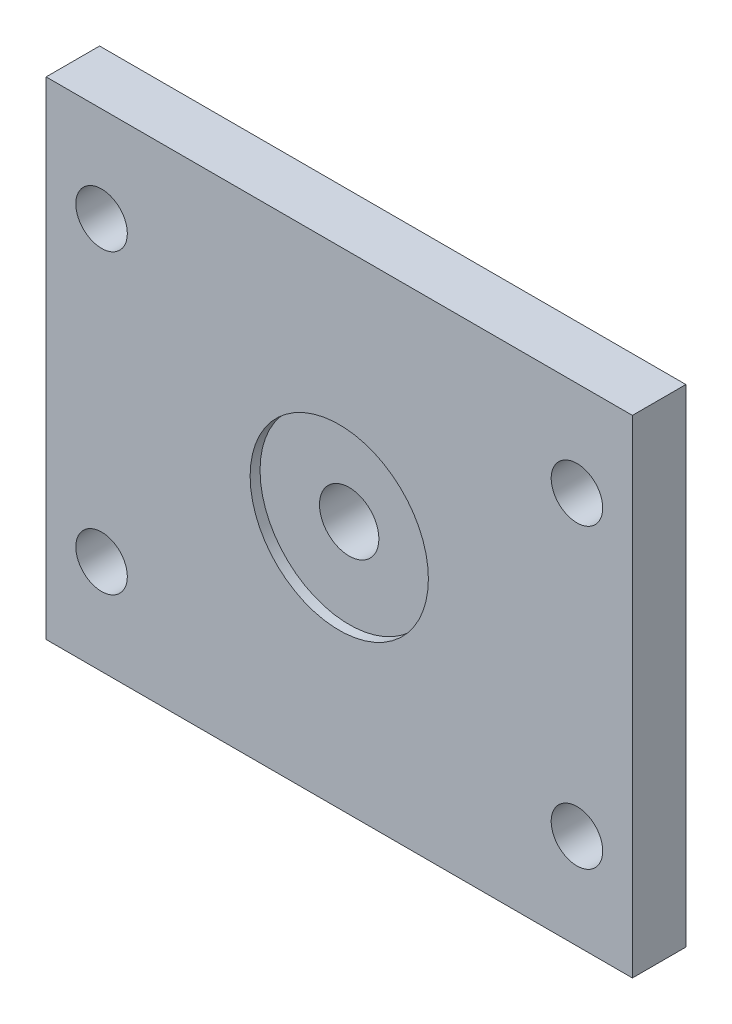
ISO-10303-21;
HEADER;
FILE_DESCRIPTION(('STEP AP214'),'2;1');
FILE_NAME('part.step','',(''),(''),'','','');
FILE_SCHEMA(('AUTOMOTIVE_DESIGN { 1 0 10303 214 1 1 1 1 }'));
ENDSEC;
DATA;
#1=APPLICATION_CONTEXT('core data for automotive mechanical design processes');
#2=APPLICATION_PROTOCOL_DEFINITION('international standard','automotive_design',2000,#1);
#3=PRODUCT_CONTEXT('',#1,'mechanical');
#4=PRODUCT('Part','Part','',(#3));
#5=PRODUCT_RELATED_PRODUCT_CATEGORY('part','',(#4));
#6=PRODUCT_DEFINITION_FORMATION('','',#4);
#7=PRODUCT_DEFINITION_CONTEXT('part definition',#1,'design');
#8=PRODUCT_DEFINITION('design','',#6,#7);
#9=PRODUCT_DEFINITION_SHAPE('','',#8);
#10=(LENGTH_UNIT() NAMED_UNIT(*) SI_UNIT(.MILLI.,.METRE.));
#11=(NAMED_UNIT(*) PLANE_ANGLE_UNIT() SI_UNIT($,.RADIAN.));
#12=(NAMED_UNIT(*) SI_UNIT($,.STERADIAN.) SOLID_ANGLE_UNIT());
#13=UNCERTAINTY_MEASURE_WITH_UNIT(LENGTH_MEASURE(1.E-05),#10,'distance_accuracy_value','');
#14=(GEOMETRIC_REPRESENTATION_CONTEXT(3) GLOBAL_UNCERTAINTY_ASSIGNED_CONTEXT((#13)) GLOBAL_UNIT_ASSIGNED_CONTEXT((#10,
#11,#12)) REPRESENTATION_CONTEXT('',''));
#15=CARTESIAN_POINT('',(0.,0.,0.));
#16=DIRECTION('',(0.,0.,1.));
#17=DIRECTION('',(1.,0.,0.));
#18=AXIS2_PLACEMENT_3D('',#15,#16,#17);
#19=CARTESIAN_POINT('',(0.,0.,27.));
#20=DIRECTION('',(0.,0.,-1.));
#21=DIRECTION('',(-1.,0.,0.));
#22=AXIS2_PLACEMENT_3D('',#19,#20,#21);
#23=CYLINDRICAL_SURFACE('',#22,15.);
#24=CARTESIAN_POINT('',(0.,0.,0.));
#25=DIRECTION('',(0.,0.,1.));
#26=DIRECTION('',(1.,0.,0.));
#27=AXIS2_PLACEMENT_3D('',#24,#25,#26);
#28=CIRCLE('',#27,15.);
#29=CARTESIAN_POINT('',(15.,0.,0.));
#30=VERTEX_POINT('',#29);
#31=EDGE_CURVE('E138',#30,#30,#28,.T.);
#32=ORIENTED_EDGE('',*,*,#31,.F.);
#33=EDGE_LOOP('',(#32));
#34=FACE_BOUND('',#33,.T.);
#35=CARTESIAN_POINT('',(0.,0.,22.));
#36=DIRECTION('',(0.,0.,1.));
#37=DIRECTION('',(1.,0.,0.));
#38=AXIS2_PLACEMENT_3D('',#35,#36,#37);
#39=CIRCLE('',#38,15.);
#40=CARTESIAN_POINT('',(15.,0.,22.));
#41=VERTEX_POINT('',#40);
#42=EDGE_CURVE('E39',#41,#41,#39,.T.);
#43=ORIENTED_EDGE('',*,*,#42,.T.);
#44=EDGE_LOOP('',(#43));
#45=FACE_BOUND('',#44,.T.);
#46=ADVANCED_FACE('F35',(#34,#45),#23,.F.);
#47=CARTESIAN_POINT('',(-148.,123.,27.));
#48=DIRECTION('',(0.,0.,1.));
#49=DIRECTION('',(1.,0.,0.));
#50=AXIS2_PLACEMENT_3D('',#47,#48,#49);
#51=PLANE('',#50);
#52=CARTESIAN_POINT('',(0.,0.,27.));
#53=DIRECTION('',(0.,0.,1.));
#54=DIRECTION('',(1.,0.,0.));
#55=AXIS2_PLACEMENT_3D('',#52,#53,#54);
#56=CIRCLE('',#55,45.);
#57=CARTESIAN_POINT('',(45.,0.,27.));
#58=VERTEX_POINT('',#57);
#59=EDGE_CURVE('E143',#58,#58,#56,.T.);
#60=ORIENTED_EDGE('',*,*,#59,.F.);
#61=EDGE_LOOP('',(#60));
#62=FACE_BOUND('',#61,.T.);
#63=CARTESIAN_POINT('',(-120.,-75.,27.));
#64=DIRECTION('',(0.,0.,1.));
#65=DIRECTION('',(1.,0.,0.));
#66=AXIS2_PLACEMENT_3D('',#63,#64,#65);
#67=CIRCLE('',#66,13.);
#68=CARTESIAN_POINT('',(-107.,-75.,27.));
#69=VERTEX_POINT('',#68);
#70=EDGE_CURVE('E132',#69,#69,#67,.T.);
#71=ORIENTED_EDGE('',*,*,#70,.F.);
#72=EDGE_LOOP('',(#71));
#73=FACE_BOUND('',#72,.T.);
#74=CARTESIAN_POINT('',(120.,75.,27.));
#75=DIRECTION('',(0.,0.,1.));
#76=DIRECTION('',(1.,0.,0.));
#77=AXIS2_PLACEMENT_3D('',#74,#75,#76);
#78=CIRCLE('',#77,13.);
#79=CARTESIAN_POINT('',(133.,75.,27.));
#80=VERTEX_POINT('',#79);
#81=EDGE_CURVE('E120',#80,#80,#78,.T.);
#82=ORIENTED_EDGE('',*,*,#81,.F.);
#83=EDGE_LOOP('',(#82));
#84=FACE_BOUND('',#83,.T.);
#85=DIRECTION('',(0.,-1.,0.));
#86=VECTOR('',#85,1.);
#87=CARTESIAN_POINT('',(-148.,-123.,27.));
#88=LINE('',#87,#86);
#89=CARTESIAN_POINT('',(-148.,123.,27.));
#90=VERTEX_POINT('',#89);
#91=CARTESIAN_POINT('',(-148.,-123.,27.));
#92=VERTEX_POINT('',#91);
#93=EDGE_CURVE('E89',#90,#92,#88,.T.);
#94=ORIENTED_EDGE('',*,*,#93,.T.);
#95=DIRECTION('',(1.,0.,0.));
#96=VECTOR('',#95,1.);
#97=CARTESIAN_POINT('',(148.,-123.,27.));
#98=LINE('',#97,#96);
#99=CARTESIAN_POINT('',(148.,-123.,27.));
#100=VERTEX_POINT('',#99);
#101=EDGE_CURVE('E83',#92,#100,#98,.T.);
#102=ORIENTED_EDGE('',*,*,#101,.T.);
#103=DIRECTION('',(0.,1.,0.));
#104=VECTOR('',#103,1.);
#105=CARTESIAN_POINT('',(148.,-123.,27.));
#106=LINE('',#105,#104);
#107=CARTESIAN_POINT('',(148.,123.,27.));
#108=VERTEX_POINT('',#107);
#109=EDGE_CURVE('E87',#100,#108,#106,.T.);
#110=ORIENTED_EDGE('',*,*,#109,.T.);
#111=DIRECTION('',(-1.,0.,0.));
#112=VECTOR('',#111,1.);
#113=CARTESIAN_POINT('',(148.,123.,27.));
#114=LINE('',#113,#112);
#115=EDGE_CURVE('E53',#108,#90,#114,.T.);
#116=ORIENTED_EDGE('',*,*,#115,.T.);
#117=EDGE_LOOP('',(#94,#102,#110,#116));
#118=FACE_BOUND('',#117,.T.);
#119=CARTESIAN_POINT('',(-120.,75.,27.));
#120=DIRECTION('',(0.,0.,1.));
#121=DIRECTION('',(1.,0.,0.));
#122=AXIS2_PLACEMENT_3D('',#119,#120,#121);
#123=CIRCLE('',#122,13.);
#124=CARTESIAN_POINT('',(-107.,75.,27.));
#125=VERTEX_POINT('',#124);
#126=EDGE_CURVE('E105',#125,#125,#123,.T.);
#127=ORIENTED_EDGE('',*,*,#126,.F.);
#128=EDGE_LOOP('',(#127));
#129=FACE_BOUND('',#128,.T.);
#130=CARTESIAN_POINT('',(120.,-75.,27.));
#131=DIRECTION('',(0.,0.,1.));
#132=DIRECTION('',(1.,0.,0.));
#133=AXIS2_PLACEMENT_3D('',#130,#131,#132);
#134=CIRCLE('',#133,13.);
#135=CARTESIAN_POINT('',(133.,-75.,27.));
#136=VERTEX_POINT('',#135);
#137=EDGE_CURVE('E126',#136,#136,#134,.T.);
#138=ORIENTED_EDGE('',*,*,#137,.F.);
#139=EDGE_LOOP('',(#138));
#140=FACE_BOUND('',#139,.T.);
#141=ADVANCED_FACE('F84',(#62,#73,#84,#118,#129,#140),#51,.T.);
#142=CARTESIAN_POINT('',(-148.,123.,0.));
#143=DIRECTION('',(0.,0.,1.));
#144=DIRECTION('',(1.,0.,0.));
#145=AXIS2_PLACEMENT_3D('',#142,#143,#144);
#146=PLANE('',#145);
#147=CARTESIAN_POINT('',(-120.,-75.,0.));
#148=DIRECTION('',(0.,0.,1.));
#149=DIRECTION('',(1.,0.,0.));
#150=AXIS2_PLACEMENT_3D('',#147,#148,#149);
#151=CIRCLE('',#150,13.);
#152=CARTESIAN_POINT('',(-107.,-75.,0.));
#153=VERTEX_POINT('',#152);
#154=EDGE_CURVE('E135',#153,#153,#151,.T.);
#155=ORIENTED_EDGE('',*,*,#154,.T.);
#156=EDGE_LOOP('',(#155));
#157=FACE_BOUND('',#156,.T.);
#158=CARTESIAN_POINT('',(120.,75.,0.));
#159=DIRECTION('',(0.,0.,1.));
#160=DIRECTION('',(1.,0.,0.));
#161=AXIS2_PLACEMENT_3D('',#158,#159,#160);
#162=CIRCLE('',#161,13.);
#163=CARTESIAN_POINT('',(133.,75.,0.));
#164=VERTEX_POINT('',#163);
#165=EDGE_CURVE('E123',#164,#164,#162,.T.);
#166=ORIENTED_EDGE('',*,*,#165,.T.);
#167=EDGE_LOOP('',(#166));
#168=FACE_BOUND('',#167,.T.);
#169=DIRECTION('',(0.,-1.,0.));
#170=VECTOR('',#169,1.);
#171=CARTESIAN_POINT('',(-148.,-123.,0.));
#172=LINE('',#171,#170);
#173=CARTESIAN_POINT('',(-148.,123.,0.));
#174=VERTEX_POINT('',#173);
#175=CARTESIAN_POINT('',(-148.,-123.,0.));
#176=VERTEX_POINT('',#175);
#177=EDGE_CURVE('E102',#174,#176,#172,.T.);
#178=ORIENTED_EDGE('',*,*,#177,.F.);
#179=DIRECTION('',(-1.,0.,0.));
#180=VECTOR('',#179,1.);
#181=CARTESIAN_POINT('',(148.,123.,0.));
#182=LINE('',#181,#180);
#183=CARTESIAN_POINT('',(148.,123.,0.));
#184=VERTEX_POINT('',#183);
#185=EDGE_CURVE('E76',#184,#174,#182,.T.);
#186=ORIENTED_EDGE('',*,*,#185,.F.);
#187=DIRECTION('',(0.,1.,0.));
#188=VECTOR('',#187,1.);
#189=CARTESIAN_POINT('',(148.,-123.,0.));
#190=LINE('',#189,#188);
#191=CARTESIAN_POINT('',(148.,-123.,0.));
#192=VERTEX_POINT('',#191);
#193=EDGE_CURVE('E70',#192,#184,#190,.T.);
#194=ORIENTED_EDGE('',*,*,#193,.F.);
#195=DIRECTION('',(1.,0.,0.));
#196=VECTOR('',#195,1.);
#197=CARTESIAN_POINT('',(148.,-123.,0.));
#198=LINE('',#197,#196);
#199=EDGE_CURVE('E93',#176,#192,#198,.T.);
#200=ORIENTED_EDGE('',*,*,#199,.F.);
#201=EDGE_LOOP('',(#178,#186,#194,#200));
#202=FACE_BOUND('',#201,.T.);
#203=CARTESIAN_POINT('',(-120.,75.,0.));
#204=DIRECTION('',(0.,0.,1.));
#205=DIRECTION('',(1.,0.,0.));
#206=AXIS2_PLACEMENT_3D('',#203,#204,#205);
#207=CIRCLE('',#206,13.);
#208=CARTESIAN_POINT('',(-107.,75.,0.));
#209=VERTEX_POINT('',#208);
#210=EDGE_CURVE('E117',#209,#209,#207,.T.);
#211=ORIENTED_EDGE('',*,*,#210,.T.);
#212=EDGE_LOOP('',(#211));
#213=FACE_BOUND('',#212,.T.);
#214=CARTESIAN_POINT('',(120.,-75.,0.));
#215=DIRECTION('',(0.,0.,1.));
#216=DIRECTION('',(1.,0.,0.));
#217=AXIS2_PLACEMENT_3D('',#214,#215,#216);
#218=CIRCLE('',#217,13.);
#219=CARTESIAN_POINT('',(133.,-75.,0.));
#220=VERTEX_POINT('',#219);
#221=EDGE_CURVE('E129',#220,#220,#218,.T.);
#222=ORIENTED_EDGE('',*,*,#221,.T.);
#223=EDGE_LOOP('',(#222));
#224=FACE_BOUND('',#223,.T.);
#225=ORIENTED_EDGE('',*,*,#31,.T.);
#226=EDGE_LOOP('',(#225));
#227=FACE_BOUND('',#226,.T.);
#228=ADVANCED_FACE('F113',(#157,#168,#202,#213,#224,#227),#146,.F.);
#229=CARTESIAN_POINT('',(-148.,-123.,27.));
#230=DIRECTION('',(1.,0.,0.));
#231=DIRECTION('',(0.,0.,-1.));
#232=AXIS2_PLACEMENT_3D('',#229,#230,#231);
#233=PLANE('',#232);
#234=ORIENTED_EDGE('',*,*,#177,.T.);
#235=DIRECTION('',(0.,0.,-1.));
#236=VECTOR('',#235,1.);
#237=CARTESIAN_POINT('',(-148.,-123.,27.));
#238=LINE('',#237,#236);
#239=EDGE_CURVE('E11',#92,#176,#238,.T.);
#240=ORIENTED_EDGE('',*,*,#239,.F.);
#241=ORIENTED_EDGE('',*,*,#93,.F.);
#242=DIRECTION('',(0.,0.,-1.));
#243=VECTOR('',#242,1.);
#244=CARTESIAN_POINT('',(-148.,123.,27.));
#245=LINE('',#244,#243);
#246=EDGE_CURVE('E98',#90,#174,#245,.T.);
#247=ORIENTED_EDGE('',*,*,#246,.T.);
#248=EDGE_LOOP('',(#234,#240,#241,#247));
#249=FACE_BOUND('',#248,.T.);
#250=ADVANCED_FACE('F37',(#249),#233,.F.);
#251=CARTESIAN_POINT('',(148.,-123.,27.));
#252=DIRECTION('',(0.,1.,0.));
#253=DIRECTION('',(-1.,0.,0.));
#254=AXIS2_PLACEMENT_3D('',#251,#252,#253);
#255=PLANE('',#254);
#256=ORIENTED_EDGE('',*,*,#199,.T.);
#257=DIRECTION('',(0.,0.,-1.));
#258=VECTOR('',#257,1.);
#259=CARTESIAN_POINT('',(148.,-123.,27.));
#260=LINE('',#259,#258);
#261=EDGE_CURVE('E45',#100,#192,#260,.T.);
#262=ORIENTED_EDGE('',*,*,#261,.F.);
#263=ORIENTED_EDGE('',*,*,#101,.F.);
#264=ORIENTED_EDGE('',*,*,#239,.T.);
#265=EDGE_LOOP('',(#256,#262,#263,#264));
#266=FACE_BOUND('',#265,.T.);
#267=ADVANCED_FACE('F92',(#266),#255,.F.);
#268=CARTESIAN_POINT('',(148.,-123.,27.));
#269=DIRECTION('',(-1.,0.,0.));
#270=DIRECTION('',(0.,0.,1.));
#271=AXIS2_PLACEMENT_3D('',#268,#269,#270);
#272=PLANE('',#271);
#273=ORIENTED_EDGE('',*,*,#193,.T.);
#274=DIRECTION('',(0.,0.,-1.));
#275=VECTOR('',#274,1.);
#276=CARTESIAN_POINT('',(148.,123.,27.));
#277=LINE('',#276,#275);
#278=EDGE_CURVE('E94',#108,#184,#277,.T.);
#279=ORIENTED_EDGE('',*,*,#278,.F.);
#280=ORIENTED_EDGE('',*,*,#109,.F.);
#281=ORIENTED_EDGE('',*,*,#261,.T.);
#282=EDGE_LOOP('',(#273,#279,#280,#281));
#283=FACE_BOUND('',#282,.T.);
#284=ADVANCED_FACE('F96',(#283),#272,.F.);
#285=CARTESIAN_POINT('',(148.,123.,27.));
#286=DIRECTION('',(0.,-1.,0.));
#287=DIRECTION('',(0.,0.,-1.));
#288=AXIS2_PLACEMENT_3D('',#285,#286,#287);
#289=PLANE('',#288);
#290=ORIENTED_EDGE('',*,*,#185,.T.);
#291=ORIENTED_EDGE('',*,*,#246,.F.);
#292=ORIENTED_EDGE('',*,*,#115,.F.);
#293=ORIENTED_EDGE('',*,*,#278,.T.);
#294=EDGE_LOOP('',(#290,#291,#292,#293));
#295=FACE_BOUND('',#294,.T.);
#296=ADVANCED_FACE('F110',(#295),#289,.F.);
#297=CARTESIAN_POINT('',(-120.,75.,27.));
#298=DIRECTION('',(0.,0.,-1.));
#299=DIRECTION('',(-1.,0.,0.));
#300=AXIS2_PLACEMENT_3D('',#297,#298,#299);
#301=CYLINDRICAL_SURFACE('',#300,13.);
#302=ORIENTED_EDGE('',*,*,#126,.T.);
#303=EDGE_LOOP('',(#302));
#304=FACE_BOUND('',#303,.T.);
#305=ORIENTED_EDGE('',*,*,#210,.F.);
#306=EDGE_LOOP('',(#305));
#307=FACE_BOUND('',#306,.T.);
#308=ADVANCED_FACE('F184',(#304,#307),#301,.F.);
#309=CARTESIAN_POINT('',(120.,75.,27.));
#310=DIRECTION('',(0.,0.,-1.));
#311=DIRECTION('',(-1.,0.,0.));
#312=AXIS2_PLACEMENT_3D('',#309,#310,#311);
#313=CYLINDRICAL_SURFACE('',#312,13.);
#314=ORIENTED_EDGE('',*,*,#81,.T.);
#315=EDGE_LOOP('',(#314));
#316=FACE_BOUND('',#315,.T.);
#317=ORIENTED_EDGE('',*,*,#165,.F.);
#318=EDGE_LOOP('',(#317));
#319=FACE_BOUND('',#318,.T.);
#320=ADVANCED_FACE('F180',(#316,#319),#313,.F.);
#321=CARTESIAN_POINT('',(120.,-75.,27.));
#322=DIRECTION('',(0.,0.,-1.));
#323=DIRECTION('',(-1.,0.,0.));
#324=AXIS2_PLACEMENT_3D('',#321,#322,#323);
#325=CYLINDRICAL_SURFACE('',#324,13.);
#326=ORIENTED_EDGE('',*,*,#137,.T.);
#327=EDGE_LOOP('',(#326));
#328=FACE_BOUND('',#327,.T.);
#329=ORIENTED_EDGE('',*,*,#221,.F.);
#330=EDGE_LOOP('',(#329));
#331=FACE_BOUND('',#330,.T.);
#332=ADVANCED_FACE('F176',(#328,#331),#325,.F.);
#333=CARTESIAN_POINT('',(-120.,-75.,27.));
#334=DIRECTION('',(0.,0.,-1.));
#335=DIRECTION('',(-1.,0.,0.));
#336=AXIS2_PLACEMENT_3D('',#333,#334,#335);
#337=CYLINDRICAL_SURFACE('',#336,13.);
#338=ORIENTED_EDGE('',*,*,#70,.T.);
#339=EDGE_LOOP('',(#338));
#340=FACE_BOUND('',#339,.T.);
#341=ORIENTED_EDGE('',*,*,#154,.F.);
#342=EDGE_LOOP('',(#341));
#343=FACE_BOUND('',#342,.T.);
#344=ADVANCED_FACE('F161',(#340,#343),#337,.F.);
#345=CARTESIAN_POINT('',(0.,0.,22.));
#346=DIRECTION('',(0.,0.,1.));
#347=DIRECTION('',(1.,0.,0.));
#348=AXIS2_PLACEMENT_3D('',#345,#346,#347);
#349=CYLINDRICAL_SURFACE('',#348,45.);
#350=CARTESIAN_POINT('',(0.,0.,22.));
#351=DIRECTION('',(0.,0.,1.));
#352=DIRECTION('',(1.,0.,0.));
#353=AXIS2_PLACEMENT_3D('',#350,#351,#352);
#354=CIRCLE('',#353,45.);
#355=CARTESIAN_POINT('',(45.,0.,22.));
#356=VERTEX_POINT('',#355);
#357=EDGE_CURVE('E146',#356,#356,#354,.T.);
#358=ORIENTED_EDGE('',*,*,#357,.F.);
#359=EDGE_LOOP('',(#358));
#360=FACE_BOUND('',#359,.T.);
#361=ORIENTED_EDGE('',*,*,#59,.T.);
#362=EDGE_LOOP('',(#361));
#363=FACE_BOUND('',#362,.T.);
#364=ADVANCED_FACE('F156',(#360,#363),#349,.F.);
#365=CARTESIAN_POINT('',(0.,0.,22.));
#366=DIRECTION('',(0.,0.,1.));
#367=DIRECTION('',(1.,0.,0.));
#368=AXIS2_PLACEMENT_3D('',#365,#366,#367);
#369=PLANE('',#368);
#370=ORIENTED_EDGE('',*,*,#42,.F.);
#371=EDGE_LOOP('',(#370));
#372=FACE_BOUND('',#371,.T.);
#373=ORIENTED_EDGE('',*,*,#357,.T.);
#374=EDGE_LOOP('',(#373));
#375=FACE_BOUND('',#374,.T.);
#376=ADVANCED_FACE('F154',(#372,#375),#369,.T.);
#377=CLOSED_SHELL('',(#46,#141,#228,#250,#267,#284,#296,#308,#320,#332,#344,#364,#376));
#378=MANIFOLD_SOLID_BREP('B2',#377);
#379=ADVANCED_BREP_SHAPE_REPRESENTATION('',(#18,#378),#14);
#380=SHAPE_DEFINITION_REPRESENTATION(#9,#379);
ENDSEC;
END-ISO-10303-21;
